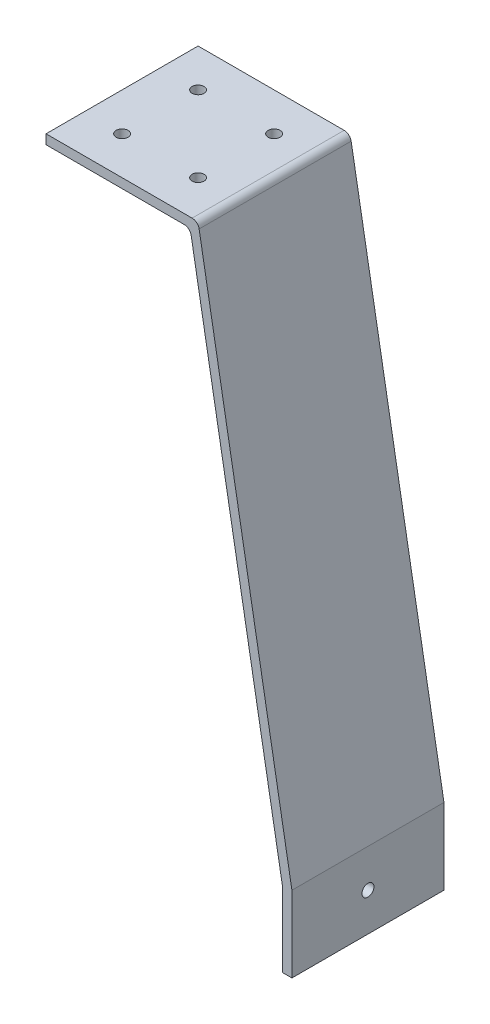
ISO-10303-21;
HEADER;
FILE_DESCRIPTION(('STEP AP214'),'2;1');
FILE_NAME('part.step','',(''),(''),'','','');
FILE_SCHEMA(('AUTOMOTIVE_DESIGN { 1 0 10303 214 1 1 1 1 }'));
ENDSEC;
DATA;
#1=APPLICATION_CONTEXT('core data for automotive mechanical design processes');
#2=APPLICATION_PROTOCOL_DEFINITION('international standard','automotive_design',2000,#1);
#3=PRODUCT_CONTEXT('',#1,'mechanical');
#4=PRODUCT('Part','Part','',(#3));
#5=PRODUCT_RELATED_PRODUCT_CATEGORY('part','',(#4));
#6=PRODUCT_DEFINITION_FORMATION('','',#4);
#7=PRODUCT_DEFINITION_CONTEXT('part definition',#1,'design');
#8=PRODUCT_DEFINITION('design','',#6,#7);
#9=PRODUCT_DEFINITION_SHAPE('','',#8);
#10=(LENGTH_UNIT() NAMED_UNIT(*) SI_UNIT(.MILLI.,.METRE.));
#11=(NAMED_UNIT(*) PLANE_ANGLE_UNIT() SI_UNIT($,.RADIAN.));
#12=(NAMED_UNIT(*) SI_UNIT($,.STERADIAN.) SOLID_ANGLE_UNIT());
#13=UNCERTAINTY_MEASURE_WITH_UNIT(LENGTH_MEASURE(1.E-05),#10,'distance_accuracy_value','');
#14=(GEOMETRIC_REPRESENTATION_CONTEXT(3) GLOBAL_UNCERTAINTY_ASSIGNED_CONTEXT((#13)) GLOBAL_UNIT_ASSIGNED_CONTEXT((#10,
#11,#12)) REPRESENTATION_CONTEXT('',''));
#15=CARTESIAN_POINT('',(0.,0.,0.));
#16=DIRECTION('',(0.,0.,1.));
#17=DIRECTION('',(1.,0.,0.));
#18=AXIS2_PLACEMENT_3D('',#15,#16,#17);
#19=CARTESIAN_POINT('',(0.,-3.17500000000001,25.4));
#20=DIRECTION('',(1.,0.,0.));
#21=DIRECTION('',(0.,0.,-1.));
#22=AXIS2_PLACEMENT_3D('',#19,#20,#21);
#23=PLANE('',#22);
#24=DIRECTION('',(0.,-1.,0.));
#25=VECTOR('',#24,1.);
#26=CARTESIAN_POINT('',(0.,-3.17500000000001,-25.4));
#27=LINE('',#26,#25);
#28=CARTESIAN_POINT('',(0.,0.,-25.4));
#29=VERTEX_POINT('',#28);
#30=CARTESIAN_POINT('',(0.,-3.17500000000001,-25.4));
#31=VERTEX_POINT('',#30);
#32=EDGE_CURVE('E142',#29,#31,#27,.T.);
#33=ORIENTED_EDGE('',*,*,#32,.T.);
#34=DIRECTION('',(0.,0.,-1.));
#35=VECTOR('',#34,1.);
#36=CARTESIAN_POINT('',(0.,-3.17500000000001,25.4));
#37=LINE('',#36,#35);
#38=CARTESIAN_POINT('',(0.,-3.17500000000001,25.4));
#39=VERTEX_POINT('',#38);
#40=EDGE_CURVE('E124',#39,#31,#37,.T.);
#41=ORIENTED_EDGE('',*,*,#40,.F.);
#42=DIRECTION('',(0.,-1.,0.));
#43=VECTOR('',#42,1.);
#44=CARTESIAN_POINT('',(0.,-3.17500000000001,25.4));
#45=LINE('',#44,#43);
#46=CARTESIAN_POINT('',(0.,0.,25.4));
#47=VERTEX_POINT('',#46);
#48=EDGE_CURVE('E128',#47,#39,#45,.T.);
#49=ORIENTED_EDGE('',*,*,#48,.F.);
#50=DIRECTION('',(0.,0.,-1.));
#51=VECTOR('',#50,1.);
#52=CARTESIAN_POINT('',(0.,0.,25.4));
#53=LINE('',#52,#51);
#54=EDGE_CURVE('E203',#47,#29,#53,.T.);
#55=ORIENTED_EDGE('',*,*,#54,.T.);
#56=EDGE_LOOP('',(#33,#41,#49,#55));
#57=FACE_BOUND('',#56,.T.);
#58=ADVANCED_FACE('F45',(#57),#23,.F.);
#59=CARTESIAN_POINT('',(48.1358586710121,-3.175,25.4));
#60=DIRECTION('',(0.,1.,0.));
#61=DIRECTION('',(-1.,0.,0.));
#62=AXIS2_PLACEMENT_3D('',#59,#60,#61);
#63=PLANE('',#62);
#64=CARTESIAN_POINT('',(38.1,-3.175,12.7));
#65=DIRECTION('',(0.,1.,0.));
#66=DIRECTION('',(-1.,0.,0.));
#67=AXIS2_PLACEMENT_3D('',#64,#65,#66);
#68=CIRCLE('',#67,2.);
#69=CARTESIAN_POINT('',(36.1,-3.175,12.7));
#70=VERTEX_POINT('',#69);
#71=EDGE_CURVE('E205',#70,#70,#68,.T.);
#72=ORIENTED_EDGE('',*,*,#71,.T.);
#73=EDGE_LOOP('',(#72));
#74=FACE_BOUND('',#73,.T.);
#75=CARTESIAN_POINT('',(38.1,-3.175,-12.7));
#76=DIRECTION('',(0.,1.,0.));
#77=DIRECTION('',(-1.,0.,0.));
#78=AXIS2_PLACEMENT_3D('',#75,#76,#77);
#79=CIRCLE('',#78,2.);
#80=CARTESIAN_POINT('',(36.1,-3.175,-12.7));
#81=VERTEX_POINT('',#80);
#82=EDGE_CURVE('E444',#81,#81,#79,.T.);
#83=ORIENTED_EDGE('',*,*,#82,.T.);
#84=EDGE_LOOP('',(#83));
#85=FACE_BOUND('',#84,.T.);
#86=CARTESIAN_POINT('',(12.7,-3.175,-12.7));
#87=DIRECTION('',(0.,1.,0.));
#88=DIRECTION('',(-1.,0.,0.));
#89=AXIS2_PLACEMENT_3D('',#86,#87,#88);
#90=CIRCLE('',#89,2.);
#91=CARTESIAN_POINT('',(10.7,-3.175,-12.7));
#92=VERTEX_POINT('',#91);
#93=EDGE_CURVE('E440',#92,#92,#90,.T.);
#94=ORIENTED_EDGE('',*,*,#93,.T.);
#95=EDGE_LOOP('',(#94));
#96=FACE_BOUND('',#95,.T.);
#97=CARTESIAN_POINT('',(12.7,-3.175,12.7));
#98=DIRECTION('',(0.,1.,0.));
#99=DIRECTION('',(-1.,0.,0.));
#100=AXIS2_PLACEMENT_3D('',#97,#98,#99);
#101=CIRCLE('',#100,2.);
#102=CARTESIAN_POINT('',(10.7,-3.175,12.7));
#103=VERTEX_POINT('',#102);
#104=EDGE_CURVE('E436',#103,#103,#101,.T.);
#105=ORIENTED_EDGE('',*,*,#104,.T.);
#106=EDGE_LOOP('',(#105));
#107=FACE_BOUND('',#106,.T.);
#108=DIRECTION('',(1.,0.,0.));
#109=VECTOR('',#108,1.);
#110=CARTESIAN_POINT('',(48.1358586710121,-3.175,-25.4));
#111=LINE('',#110,#109);
#112=CARTESIAN_POINT('',(46.1388015488102,-3.175,-25.4));
#113=VERTEX_POINT('',#112);
#114=EDGE_CURVE('E175',#31,#113,#111,.T.);
#115=ORIENTED_EDGE('',*,*,#114,.T.);
#116=DIRECTION('',(0.,0.,-1.));
#117=VECTOR('',#116,1.);
#118=CARTESIAN_POINT('',(46.1388015488102,-3.175,25.4));
#119=LINE('',#118,#117);
#120=CARTESIAN_POINT('',(46.1388015488102,-3.175,25.4));
#121=VERTEX_POINT('',#120);
#122=EDGE_CURVE('E67',#113,#121,#119,.F.);
#123=ORIENTED_EDGE('',*,*,#122,.T.);
#124=DIRECTION('',(1.,0.,0.));
#125=VECTOR('',#124,1.);
#126=CARTESIAN_POINT('',(48.1358586710121,-3.175,25.4));
#127=LINE('',#126,#125);
#128=EDGE_CURVE('E120',#39,#121,#127,.T.);
#129=ORIENTED_EDGE('',*,*,#128,.F.);
#130=ORIENTED_EDGE('',*,*,#40,.T.);
#131=EDGE_LOOP('',(#115,#123,#129,#130));
#132=FACE_BOUND('',#131,.T.);
#133=ADVANCED_FACE('F122',(#74,#85,#96,#107,#132),#63,.F.);
#134=CARTESIAN_POINT('',(78.9759371699652,-178.077776506695,25.4));
#135=DIRECTION('',(0.984807753012208,0.173648177666931,0.));
#136=DIRECTION('',(-0.173648177666931,0.984807753012208,0.));
#137=AXIS2_PLACEMENT_3D('',#134,#135,#136);
#138=PLANE('',#137);
#139=DIRECTION('',(0.173648177666931,-0.984807753012208,0.));
#140=VECTOR('',#139,1.);
#141=CARTESIAN_POINT('',(78.9759371699652,-178.077776506695,25.4));
#142=LINE('',#141,#140);
#143=CARTESIAN_POINT('',(48.4826440009792,-5.14171733715271,25.4));
#144=VERTEX_POINT('',#143);
#145=CARTESIAN_POINT('',(78.9759371699652,-178.077776506695,25.4));
#146=VERTEX_POINT('',#145);
#147=EDGE_CURVE('E127',#144,#146,#142,.T.);
#148=ORIENTED_EDGE('',*,*,#147,.F.);
#149=DIRECTION('',(0.,0.,-1.));
#150=VECTOR('',#149,1.);
#151=CARTESIAN_POINT('',(48.4826440009792,-5.14171733715271,-25.4));
#152=LINE('',#151,#150);
#153=CARTESIAN_POINT('',(48.4826440009792,-5.14171733715271,-25.4));
#154=VERTEX_POINT('',#153);
#155=EDGE_CURVE('E165',#144,#154,#152,.T.);
#156=ORIENTED_EDGE('',*,*,#155,.T.);
#157=DIRECTION('',(0.173648177666931,-0.984807753012208,0.));
#158=VECTOR('',#157,1.);
#159=CARTESIAN_POINT('',(78.9759371699652,-178.077776506695,-25.4));
#160=LINE('',#159,#158);
#161=CARTESIAN_POINT('',(78.9759371699652,-178.077776506695,-25.4));
#162=VERTEX_POINT('',#161);
#163=EDGE_CURVE('E177',#154,#162,#160,.T.);
#164=ORIENTED_EDGE('',*,*,#163,.T.);
#165=DIRECTION('',(0.,0.,-1.));
#166=VECTOR('',#165,1.);
#167=CARTESIAN_POINT('',(78.9759371699652,-178.077776506695,25.4));
#168=LINE('',#167,#166);
#169=EDGE_CURVE('E145',#146,#162,#168,.T.);
#170=ORIENTED_EDGE('',*,*,#169,.F.);
#171=EDGE_LOOP('',(#148,#156,#164,#170));
#172=FACE_BOUND('',#171,.T.);
#173=ADVANCED_FACE('F183',(#172),#138,.F.);
#174=CARTESIAN_POINT('',(78.9759371699652,-203.2,25.4));
#175=DIRECTION('',(1.,0.,0.));
#176=DIRECTION('',(0.,0.,-1.));
#177=AXIS2_PLACEMENT_3D('',#174,#175,#176);
#178=PLANE('',#177);
#179=CARTESIAN_POINT('',(78.9759371699652,-190.5,0.));
#180=DIRECTION('',(1.,0.,0.));
#181=DIRECTION('',(0.,0.,-1.));
#182=AXIS2_PLACEMENT_3D('',#179,#180,#181);
#183=CIRCLE('',#182,2.);
#184=CARTESIAN_POINT('',(78.9759371699652,-190.5,-2.));
#185=VERTEX_POINT('',#184);
#186=EDGE_CURVE('E413',#185,#185,#183,.T.);
#187=ORIENTED_EDGE('',*,*,#186,.T.);
#188=EDGE_LOOP('',(#187));
#189=FACE_BOUND('',#188,.T.);
#190=DIRECTION('',(0.,-1.,0.));
#191=VECTOR('',#190,1.);
#192=CARTESIAN_POINT('',(78.9759371699652,-203.2,-25.4));
#193=LINE('',#192,#191);
#194=CARTESIAN_POINT('',(78.9759371699652,-203.2,-25.4));
#195=VERTEX_POINT('',#194);
#196=EDGE_CURVE('E209',#162,#195,#193,.T.);
#197=ORIENTED_EDGE('',*,*,#196,.T.);
#198=DIRECTION('',(0.,0.,-1.));
#199=VECTOR('',#198,1.);
#200=CARTESIAN_POINT('',(78.9759371699652,-203.2,25.4));
#201=LINE('',#200,#199);
#202=CARTESIAN_POINT('',(78.9759371699652,-203.2,25.4));
#203=VERTEX_POINT('',#202);
#204=EDGE_CURVE('E153',#203,#195,#201,.T.);
#205=ORIENTED_EDGE('',*,*,#204,.F.);
#206=DIRECTION('',(0.,-1.,0.));
#207=VECTOR('',#206,1.);
#208=CARTESIAN_POINT('',(78.9759371699652,-203.2,25.4));
#209=LINE('',#208,#207);
#210=EDGE_CURVE('E187',#146,#203,#209,.T.);
#211=ORIENTED_EDGE('',*,*,#210,.F.);
#212=ORIENTED_EDGE('',*,*,#169,.T.);
#213=EDGE_LOOP('',(#197,#205,#211,#212));
#214=FACE_BOUND('',#213,.T.);
#215=ADVANCED_FACE('F346',(#189,#214),#178,.F.);
#216=CARTESIAN_POINT('',(82.1509371699652,-203.2,25.4));
#217=DIRECTION('',(0.,1.,0.));
#218=DIRECTION('',(0.,0.,1.));
#219=AXIS2_PLACEMENT_3D('',#216,#217,#218);
#220=PLANE('',#219);
#221=DIRECTION('',(1.,0.,0.));
#222=VECTOR('',#221,1.);
#223=CARTESIAN_POINT('',(82.1509371699652,-203.2,-25.4));
#224=LINE('',#223,#222);
#225=CARTESIAN_POINT('',(82.1509371699652,-203.2,-25.4));
#226=VERTEX_POINT('',#225);
#227=EDGE_CURVE('E212',#195,#226,#224,.T.);
#228=ORIENTED_EDGE('',*,*,#227,.T.);
#229=DIRECTION('',(0.,0.,-1.));
#230=VECTOR('',#229,1.);
#231=CARTESIAN_POINT('',(82.1509371699652,-203.2,25.4));
#232=LINE('',#231,#230);
#233=CARTESIAN_POINT('',(82.1509371699652,-203.2,25.4));
#234=VERTEX_POINT('',#233);
#235=EDGE_CURVE('E230',#234,#226,#232,.T.);
#236=ORIENTED_EDGE('',*,*,#235,.F.);
#237=DIRECTION('',(1.,0.,0.));
#238=VECTOR('',#237,1.);
#239=CARTESIAN_POINT('',(82.1509371699652,-203.2,25.4));
#240=LINE('',#239,#238);
#241=EDGE_CURVE('E190',#203,#234,#240,.T.);
#242=ORIENTED_EDGE('',*,*,#241,.F.);
#243=ORIENTED_EDGE('',*,*,#204,.T.);
#244=EDGE_LOOP('',(#228,#236,#242,#243));
#245=FACE_BOUND('',#244,.T.);
#246=ADVANCED_FACE('F239',(#245),#220,.F.);
#247=CARTESIAN_POINT('',(82.1509371699652,-177.8,25.4));
#248=DIRECTION('',(-1.,0.,0.));
#249=DIRECTION('',(0.,0.,1.));
#250=AXIS2_PLACEMENT_3D('',#247,#248,#249);
#251=PLANE('',#250);
#252=CARTESIAN_POINT('',(82.1509371699652,-190.5,0.));
#253=DIRECTION('',(1.,0.,0.));
#254=DIRECTION('',(0.,0.,-1.));
#255=AXIS2_PLACEMENT_3D('',#252,#253,#254);
#256=CIRCLE('',#255,2.);
#257=CARTESIAN_POINT('',(82.1509371699652,-190.5,-2.));
#258=VERTEX_POINT('',#257);
#259=EDGE_CURVE('E416',#258,#258,#256,.T.);
#260=ORIENTED_EDGE('',*,*,#259,.F.);
#261=EDGE_LOOP('',(#260));
#262=FACE_BOUND('',#261,.T.);
#263=DIRECTION('',(0.,1.,0.));
#264=VECTOR('',#263,1.);
#265=CARTESIAN_POINT('',(82.1509371699652,-177.8,-25.4));
#266=LINE('',#265,#264);
#267=CARTESIAN_POINT('',(82.1509371699652,-177.8,-25.4));
#268=VERTEX_POINT('',#267);
#269=EDGE_CURVE('E215',#226,#268,#266,.T.);
#270=ORIENTED_EDGE('',*,*,#269,.T.);
#271=DIRECTION('',(0.,0.,-1.));
#272=VECTOR('',#271,1.);
#273=CARTESIAN_POINT('',(82.1509371699652,-177.8,25.4));
#274=LINE('',#273,#272);
#275=CARTESIAN_POINT('',(82.1509371699652,-177.8,25.4));
#276=VERTEX_POINT('',#275);
#277=EDGE_CURVE('E226',#276,#268,#274,.T.);
#278=ORIENTED_EDGE('',*,*,#277,.F.);
#279=DIRECTION('',(0.,1.,0.));
#280=VECTOR('',#279,1.);
#281=CARTESIAN_POINT('',(82.1509371699652,-177.8,25.4));
#282=LINE('',#281,#280);
#283=EDGE_CURVE('E195',#234,#276,#282,.T.);
#284=ORIENTED_EDGE('',*,*,#283,.F.);
#285=ORIENTED_EDGE('',*,*,#235,.T.);
#286=EDGE_LOOP('',(#270,#278,#284,#285));
#287=FACE_BOUND('',#286,.T.);
#288=ADVANCED_FACE('F246',(#262,#287),#251,.F.);
#289=CARTESIAN_POINT('',(50.8,0.,25.4));
#290=DIRECTION('',(-0.984807753012208,-0.173648177666931,0.));
#291=DIRECTION('',(0.173648177666931,-0.984807753012208,0.));
#292=AXIS2_PLACEMENT_3D('',#289,#290,#291);
#293=PLANE('',#292);
#294=DIRECTION('',(-0.173648177666931,0.984807753012208,0.));
#295=VECTOR('',#294,1.);
#296=CARTESIAN_POINT('',(50.8,0.,-25.4));
#297=LINE('',#296,#295);
#298=CARTESIAN_POINT('',(51.1467853299671,-1.96671733715271,-25.4));
#299=VERTEX_POINT('',#298);
#300=EDGE_CURVE('E218',#268,#299,#297,.T.);
#301=ORIENTED_EDGE('',*,*,#300,.T.);
#302=DIRECTION('',(0.,0.,-1.));
#303=VECTOR('',#302,1.);
#304=CARTESIAN_POINT('',(51.1467853299671,-1.96671733715271,25.4));
#305=LINE('',#304,#303);
#306=CARTESIAN_POINT('',(51.1467853299671,-1.96671733715271,25.4));
#307=VERTEX_POINT('',#306);
#308=EDGE_CURVE('E159',#299,#307,#305,.F.);
#309=ORIENTED_EDGE('',*,*,#308,.T.);
#310=DIRECTION('',(-0.173648177666931,0.984807753012208,0.));
#311=VECTOR('',#310,1.);
#312=CARTESIAN_POINT('',(50.8,0.,25.4));
#313=LINE('',#312,#311);
#314=EDGE_CURVE('E198',#276,#307,#313,.T.);
#315=ORIENTED_EDGE('',*,*,#314,.F.);
#316=ORIENTED_EDGE('',*,*,#277,.T.);
#317=EDGE_LOOP('',(#301,#309,#315,#316));
#318=FACE_BOUND('',#317,.T.);
#319=ADVANCED_FACE('F250',(#318),#293,.F.);
#320=CARTESIAN_POINT('',(0.,0.,25.4));
#321=DIRECTION('',(0.,-1.,0.));
#322=DIRECTION('',(0.,0.,-1.));
#323=AXIS2_PLACEMENT_3D('',#320,#321,#322);
#324=PLANE('',#323);
#325=CARTESIAN_POINT('',(38.1,0.,12.7));
#326=DIRECTION('',(0.,1.,0.));
#327=DIRECTION('',(0.,0.,1.));
#328=AXIS2_PLACEMENT_3D('',#325,#326,#327);
#329=CIRCLE('',#328,2.);
#330=CARTESIAN_POINT('',(38.1,0.,14.7));
#331=VERTEX_POINT('',#330);
#332=EDGE_CURVE('E415',#331,#331,#329,.T.);
#333=ORIENTED_EDGE('',*,*,#332,.F.);
#334=EDGE_LOOP('',(#333));
#335=FACE_BOUND('',#334,.T.);
#336=CARTESIAN_POINT('',(38.1,0.,-12.7));
#337=DIRECTION('',(0.,1.,0.));
#338=DIRECTION('',(0.,0.,1.));
#339=AXIS2_PLACEMENT_3D('',#336,#337,#338);
#340=CIRCLE('',#339,2.);
#341=CARTESIAN_POINT('',(38.1,0.,-10.7));
#342=VERTEX_POINT('',#341);
#343=EDGE_CURVE('E421',#342,#342,#340,.T.);
#344=ORIENTED_EDGE('',*,*,#343,.F.);
#345=EDGE_LOOP('',(#344));
#346=FACE_BOUND('',#345,.T.);
#347=CARTESIAN_POINT('',(12.7,0.,-12.7));
#348=DIRECTION('',(0.,1.,0.));
#349=DIRECTION('',(0.,0.,1.));
#350=AXIS2_PLACEMENT_3D('',#347,#348,#349);
#351=CIRCLE('',#350,2.);
#352=CARTESIAN_POINT('',(12.7,0.,-10.7));
#353=VERTEX_POINT('',#352);
#354=EDGE_CURVE('E425',#353,#353,#351,.T.);
#355=ORIENTED_EDGE('',*,*,#354,.F.);
#356=EDGE_LOOP('',(#355));
#357=FACE_BOUND('',#356,.T.);
#358=CARTESIAN_POINT('',(12.7,0.,12.7));
#359=DIRECTION('',(0.,1.,0.));
#360=DIRECTION('',(0.,0.,1.));
#361=AXIS2_PLACEMENT_3D('',#358,#359,#360);
#362=CIRCLE('',#361,2.);
#363=CARTESIAN_POINT('',(12.7,0.,14.7));
#364=VERTEX_POINT('',#363);
#365=EDGE_CURVE('E429',#364,#364,#362,.T.);
#366=ORIENTED_EDGE('',*,*,#365,.F.);
#367=EDGE_LOOP('',(#366));
#368=FACE_BOUND('',#367,.T.);
#369=DIRECTION('',(-1.,0.,0.));
#370=VECTOR('',#369,1.);
#371=CARTESIAN_POINT('',(0.,0.,25.4));
#372=LINE('',#371,#370);
#373=CARTESIAN_POINT('',(48.8029428777981,0.,25.4));
#374=VERTEX_POINT('',#373);
#375=EDGE_CURVE('E134',#374,#47,#372,.T.);
#376=ORIENTED_EDGE('',*,*,#375,.F.);
#377=DIRECTION('',(0.,0.,-1.));
#378=VECTOR('',#377,1.);
#379=CARTESIAN_POINT('',(48.8029428777981,0.,25.4));
#380=LINE('',#379,#378);
#381=CARTESIAN_POINT('',(48.8029428777981,0.,-25.4));
#382=VERTEX_POINT('',#381);
#383=EDGE_CURVE('E144',#374,#382,#380,.T.);
#384=ORIENTED_EDGE('',*,*,#383,.T.);
#385=DIRECTION('',(-1.,0.,0.));
#386=VECTOR('',#385,1.);
#387=CARTESIAN_POINT('',(0.,0.,-25.4));
#388=LINE('',#387,#386);
#389=EDGE_CURVE('E139',#382,#29,#388,.T.);
#390=ORIENTED_EDGE('',*,*,#389,.T.);
#391=ORIENTED_EDGE('',*,*,#54,.F.);
#392=EDGE_LOOP('',(#376,#384,#390,#391));
#393=FACE_BOUND('',#392,.T.);
#394=ADVANCED_FACE('F257',(#335,#346,#357,#368,#393),#324,.F.);
#395=CARTESIAN_POINT('',(0.,0.,25.4));
#396=DIRECTION('',(0.,0.,-1.));
#397=DIRECTION('',(-1.,0.,0.));
#398=AXIS2_PLACEMENT_3D('',#395,#396,#397);
#399=PLANE('',#398);
#400=ORIENTED_EDGE('',*,*,#314,.T.);
#401=CARTESIAN_POINT('',(48.8029428777981,-2.38,25.4));
#402=DIRECTION('',(0.,0.,-1.));
#403=DIRECTION('',(-1.,0.,0.));
#404=AXIS2_PLACEMENT_3D('',#401,#402,#403);
#405=CIRCLE('',#404,2.38);
#406=EDGE_CURVE('E162',#307,#374,#405,.F.);
#407=ORIENTED_EDGE('',*,*,#406,.T.);
#408=ORIENTED_EDGE('',*,*,#375,.T.);
#409=ORIENTED_EDGE('',*,*,#48,.T.);
#410=ORIENTED_EDGE('',*,*,#128,.T.);
#411=CARTESIAN_POINT('',(46.1388015488102,-5.555,25.4));
#412=DIRECTION('',(0.,0.,-1.));
#413=DIRECTION('',(-1.,0.,0.));
#414=AXIS2_PLACEMENT_3D('',#411,#412,#413);
#415=CIRCLE('',#414,2.38);
#416=EDGE_CURVE('E11',#121,#144,#415,.T.);
#417=ORIENTED_EDGE('',*,*,#416,.T.);
#418=ORIENTED_EDGE('',*,*,#147,.T.);
#419=ORIENTED_EDGE('',*,*,#210,.T.);
#420=ORIENTED_EDGE('',*,*,#241,.T.);
#421=ORIENTED_EDGE('',*,*,#283,.T.);
#422=EDGE_LOOP('',(#400,#407,#408,#409,#410,#417,#418,#419,#420,#421));
#423=FACE_BOUND('',#422,.T.);
#424=ADVANCED_FACE('F132',(#423),#399,.F.);
#425=CARTESIAN_POINT('',(0.,0.,-25.4));
#426=DIRECTION('',(0.,0.,-1.));
#427=DIRECTION('',(-1.,0.,0.));
#428=AXIS2_PLACEMENT_3D('',#425,#426,#427);
#429=PLANE('',#428);
#430=ORIENTED_EDGE('',*,*,#389,.F.);
#431=CARTESIAN_POINT('',(48.8029428777981,-2.38,-25.4));
#432=DIRECTION('',(0.,0.,-1.));
#433=DIRECTION('',(-1.,0.,0.));
#434=AXIS2_PLACEMENT_3D('',#431,#432,#433);
#435=CIRCLE('',#434,2.38);
#436=EDGE_CURVE('E150',#382,#299,#435,.T.);
#437=ORIENTED_EDGE('',*,*,#436,.T.);
#438=ORIENTED_EDGE('',*,*,#300,.F.);
#439=ORIENTED_EDGE('',*,*,#269,.F.);
#440=ORIENTED_EDGE('',*,*,#227,.F.);
#441=ORIENTED_EDGE('',*,*,#196,.F.);
#442=ORIENTED_EDGE('',*,*,#163,.F.);
#443=CARTESIAN_POINT('',(46.1388015488102,-5.555,-25.4));
#444=DIRECTION('',(0.,0.,-1.));
#445=DIRECTION('',(-1.,0.,0.));
#446=AXIS2_PLACEMENT_3D('',#443,#444,#445);
#447=CIRCLE('',#446,2.38);
#448=EDGE_CURVE('E54',#154,#113,#447,.F.);
#449=ORIENTED_EDGE('',*,*,#448,.T.);
#450=ORIENTED_EDGE('',*,*,#114,.F.);
#451=ORIENTED_EDGE('',*,*,#32,.F.);
#452=EDGE_LOOP('',(#430,#437,#438,#439,#440,#441,#442,#449,#450,#451));
#453=FACE_BOUND('',#452,.T.);
#454=ADVANCED_FACE('F174',(#453),#429,.T.);
#455=CARTESIAN_POINT('',(12.7,-50.8,12.7));
#456=DIRECTION('',(0.,1.,0.));
#457=DIRECTION('',(0.,0.,1.));
#458=AXIS2_PLACEMENT_3D('',#455,#456,#457);
#459=CYLINDRICAL_SURFACE('',#458,2.);
#460=ORIENTED_EDGE('',*,*,#365,.T.);
#461=EDGE_LOOP('',(#460));
#462=FACE_BOUND('',#461,.T.);
#463=ORIENTED_EDGE('',*,*,#104,.F.);
#464=EDGE_LOOP('',(#463));
#465=FACE_BOUND('',#464,.T.);
#466=ADVANCED_FACE('F302',(#462,#465),#459,.F.);
#467=CARTESIAN_POINT('',(12.7,-50.8,-12.7));
#468=DIRECTION('',(0.,1.,0.));
#469=DIRECTION('',(0.,0.,1.));
#470=AXIS2_PLACEMENT_3D('',#467,#468,#469);
#471=CYLINDRICAL_SURFACE('',#470,2.);
#472=ORIENTED_EDGE('',*,*,#354,.T.);
#473=EDGE_LOOP('',(#472));
#474=FACE_BOUND('',#473,.T.);
#475=ORIENTED_EDGE('',*,*,#93,.F.);
#476=EDGE_LOOP('',(#475));
#477=FACE_BOUND('',#476,.T.);
#478=ADVANCED_FACE('F299',(#474,#477),#471,.F.);
#479=CARTESIAN_POINT('',(38.1,-50.8,-12.7));
#480=DIRECTION('',(0.,1.,0.));
#481=DIRECTION('',(0.,0.,1.));
#482=AXIS2_PLACEMENT_3D('',#479,#480,#481);
#483=CYLINDRICAL_SURFACE('',#482,2.);
#484=ORIENTED_EDGE('',*,*,#343,.T.);
#485=EDGE_LOOP('',(#484));
#486=FACE_BOUND('',#485,.T.);
#487=ORIENTED_EDGE('',*,*,#82,.F.);
#488=EDGE_LOOP('',(#487));
#489=FACE_BOUND('',#488,.T.);
#490=ADVANCED_FACE('F293',(#486,#489),#483,.F.);
#491=CARTESIAN_POINT('',(38.1,-50.8,12.7));
#492=DIRECTION('',(0.,1.,0.));
#493=DIRECTION('',(0.,0.,1.));
#494=AXIS2_PLACEMENT_3D('',#491,#492,#493);
#495=CYLINDRICAL_SURFACE('',#494,2.);
#496=ORIENTED_EDGE('',*,*,#332,.T.);
#497=EDGE_LOOP('',(#496));
#498=FACE_BOUND('',#497,.T.);
#499=ORIENTED_EDGE('',*,*,#71,.F.);
#500=EDGE_LOOP('',(#499));
#501=FACE_BOUND('',#500,.T.);
#502=ADVANCED_FACE('F286',(#498,#501),#495,.F.);
#503=CARTESIAN_POINT('',(0.,-190.5,0.));
#504=DIRECTION('',(1.,0.,0.));
#505=DIRECTION('',(0.,0.,-1.));
#506=AXIS2_PLACEMENT_3D('',#503,#504,#505);
#507=CYLINDRICAL_SURFACE('',#506,2.);
#508=ORIENTED_EDGE('',*,*,#259,.T.);
#509=EDGE_LOOP('',(#508));
#510=FACE_BOUND('',#509,.T.);
#511=ORIENTED_EDGE('',*,*,#186,.F.);
#512=EDGE_LOOP('',(#511));
#513=FACE_BOUND('',#512,.T.);
#514=ADVANCED_FACE('F280',(#510,#513),#507,.F.);
#515=CARTESIAN_POINT('',(48.8029428777981,-2.38,25.4));
#516=DIRECTION('',(0.,0.,-1.));
#517=DIRECTION('',(-1.,0.,0.));
#518=AXIS2_PLACEMENT_3D('',#515,#516,#517);
#519=CYLINDRICAL_SURFACE('',#518,2.38);
#520=ORIENTED_EDGE('',*,*,#406,.F.);
#521=ORIENTED_EDGE('',*,*,#308,.F.);
#522=ORIENTED_EDGE('',*,*,#436,.F.);
#523=ORIENTED_EDGE('',*,*,#383,.F.);
#524=EDGE_LOOP('',(#520,#521,#522,#523));
#525=FACE_BOUND('',#524,.T.);
#526=ADVANCED_FACE('F255',(#525),#519,.T.);
#527=CARTESIAN_POINT('',(46.1388015488102,-5.555,25.4));
#528=DIRECTION('',(0.,0.,1.));
#529=DIRECTION('',(1.,0.,0.));
#530=AXIS2_PLACEMENT_3D('',#527,#528,#529);
#531=CYLINDRICAL_SURFACE('',#530,2.38);
#532=ORIENTED_EDGE('',*,*,#416,.F.);
#533=ORIENTED_EDGE('',*,*,#122,.F.);
#534=ORIENTED_EDGE('',*,*,#448,.F.);
#535=ORIENTED_EDGE('',*,*,#155,.F.);
#536=EDGE_LOOP('',(#532,#533,#534,#535));
#537=FACE_BOUND('',#536,.T.);
#538=ADVANCED_FACE('F47',(#537),#531,.F.);
#539=CLOSED_SHELL('',(#58,#133,#173,#215,#246,#288,#319,#394,#424,#454,#466,#478,#490,#502,#514,
#526,#538));
#540=MANIFOLD_SOLID_BREP('B2',#539);
#541=ADVANCED_BREP_SHAPE_REPRESENTATION('',(#18,#540),#14);
#542=SHAPE_DEFINITION_REPRESENTATION(#9,#541);
ENDSEC;
END-ISO-10303-21;
